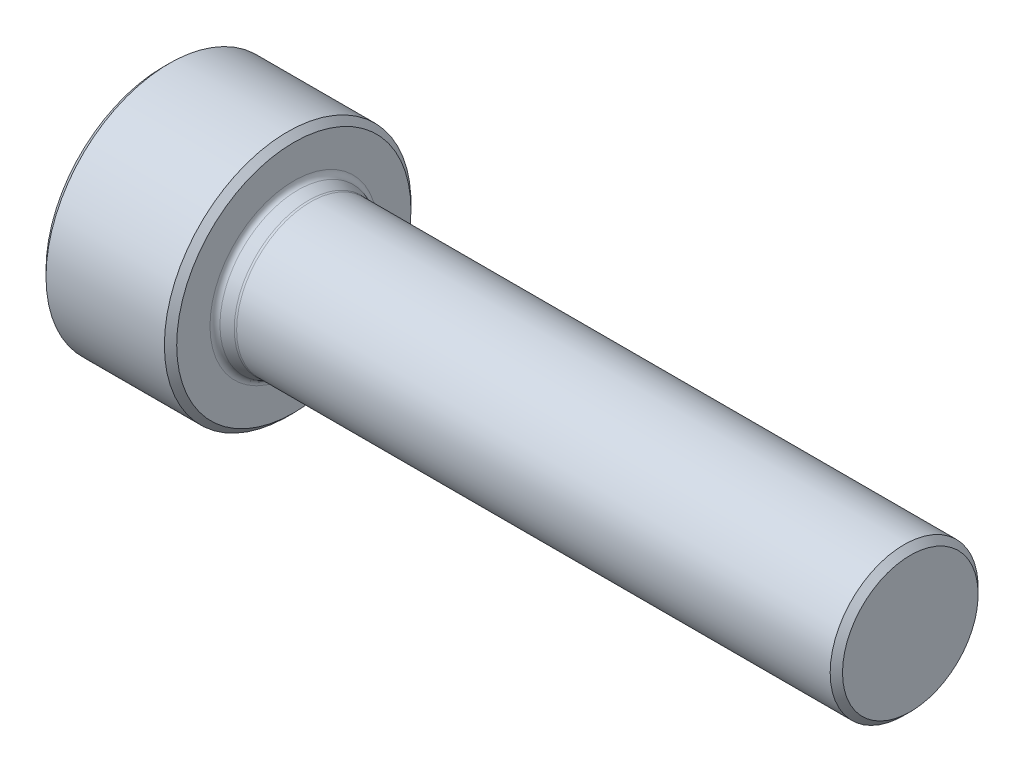
ISO-10303-21;
HEADER;
FILE_DESCRIPTION(('STEP AP214'),'2;1');
FILE_NAME('part.step','',(''),(''),'','','');
FILE_SCHEMA(('AUTOMOTIVE_DESIGN { 1 0 10303 214 1 1 1 1 }'));
ENDSEC;
DATA;
#1=APPLICATION_CONTEXT('core data for automotive mechanical design processes');
#2=APPLICATION_PROTOCOL_DEFINITION('international standard','automotive_design',2000,#1);
#3=PRODUCT_CONTEXT('',#1,'mechanical');
#4=PRODUCT('Part','Part','',(#3));
#5=PRODUCT_RELATED_PRODUCT_CATEGORY('part','',(#4));
#6=PRODUCT_DEFINITION_FORMATION('','',#4);
#7=PRODUCT_DEFINITION_CONTEXT('part definition',#1,'design');
#8=PRODUCT_DEFINITION('design','',#6,#7);
#9=PRODUCT_DEFINITION_SHAPE('','',#8);
#10=(LENGTH_UNIT() NAMED_UNIT(*) SI_UNIT(.MILLI.,.METRE.));
#11=(NAMED_UNIT(*) PLANE_ANGLE_UNIT() SI_UNIT($,.RADIAN.));
#12=(NAMED_UNIT(*) SI_UNIT($,.STERADIAN.) SOLID_ANGLE_UNIT());
#13=UNCERTAINTY_MEASURE_WITH_UNIT(LENGTH_MEASURE(1.E-05),#10,'distance_accuracy_value','');
#14=(GEOMETRIC_REPRESENTATION_CONTEXT(3) GLOBAL_UNCERTAINTY_ASSIGNED_CONTEXT((#13)) GLOBAL_UNIT_ASSIGNED_CONTEXT((#10,
#11,#12)) REPRESENTATION_CONTEXT('',''));
#15=CARTESIAN_POINT('',(0.,0.,0.));
#16=DIRECTION('',(0.,0.,1.));
#17=DIRECTION('',(1.,0.,0.));
#18=AXIS2_PLACEMENT_3D('',#15,#16,#17);
#19=CARTESIAN_POINT('',(0.679999999999998,0.,0.));
#20=DIRECTION('',(-1.,0.,0.));
#21=DIRECTION('',(0.,0.,0.999999999999998));
#22=AXIS2_PLACEMENT_3D('',#19,#20,#21);
#23=TOROIDAL_SURFACE('',#22,3.25,0.25);
#24=CARTESIAN_POINT('',(0.597656960920519,0.,0.));
#25=DIRECTION('',(-1.,0.,0.));
#26=DIRECTION('',(0.,0.,0.999999999999998));
#27=AXIS2_PLACEMENT_3D('',#24,#25,#26);
#28=CIRCLE('',#27,3.01394995463856);
#29=CARTESIAN_POINT('',(0.597656960920523,0.,3.01394995463845));
#30=VERTEX_POINT('',#29);
#31=EDGE_CURVE('E339',#30,#30,#28,.T.);
#32=ORIENTED_EDGE('',*,*,#31,.F.);
#33=EDGE_LOOP('',(#32));
#34=FACE_BOUND('',#33,.T.);
#35=CARTESIAN_POINT('',(0.680000000000019,0.,0.));
#36=DIRECTION('',(-1.,0.,0.));
#37=DIRECTION('',(0.,0.,0.999999999999998));
#38=AXIS2_PLACEMENT_3D('',#35,#36,#37);
#39=CIRCLE('',#38,3.);
#40=CARTESIAN_POINT('',(0.680000000000023,0.,2.99999999999992));
#41=VERTEX_POINT('',#40);
#42=EDGE_CURVE('E356',#41,#41,#39,.T.);
#43=ORIENTED_EDGE('',*,*,#42,.T.);
#44=EDGE_LOOP('',(#43));
#45=FACE_BOUND('',#44,.T.);
#46=ADVANCED_FACE('F38',(#34,#45),#23,.F.);
#47=CARTESIAN_POINT('',(0.597656960920519,0.,0.));
#48=DIRECTION('',(-1.,0.,0.));
#49=DIRECTION('',(0.,0.,0.999999999999998));
#50=AXIS2_PLACEMENT_3D('',#47,#48,#49);
#51=CONICAL_SURFACE('',#50,3.01394995463856,0.335638550327499);
#52=CARTESIAN_POINT('',(0.167656960920358,0.,0.));
#53=DIRECTION('',(-1.,0.,0.));
#54=DIRECTION('',(0.,0.,0.999999999999998));
#55=AXIS2_PLACEMENT_3D('',#52,#53,#54);
#56=CIRCLE('',#55,3.16394995463856);
#57=CARTESIAN_POINT('',(0.167656960920362,0.,3.16394995463848));
#58=VERTEX_POINT('',#57);
#59=EDGE_CURVE('E342',#58,#58,#56,.T.);
#60=ORIENTED_EDGE('',*,*,#59,.F.);
#61=EDGE_LOOP('',(#60));
#62=FACE_BOUND('',#61,.T.);
#63=ORIENTED_EDGE('',*,*,#31,.T.);
#64=EDGE_LOOP('',(#63));
#65=FACE_BOUND('',#64,.T.);
#66=ADVANCED_FACE('F288',(#62,#65),#51,.T.);
#67=CARTESIAN_POINT('',(0.250000000000007,0.,0.));
#68=DIRECTION('',(-1.,0.,0.));
#69=DIRECTION('',(0.,0.,0.999999999999998));
#70=AXIS2_PLACEMENT_3D('',#67,#68,#69);
#71=TOROIDAL_SURFACE('',#70,3.4,0.25);
#72=CARTESIAN_POINT('',(0.,0.,0.));
#73=DIRECTION('',(-1.,0.,0.));
#74=DIRECTION('',(0.,0.,0.999999999999998));
#75=AXIS2_PLACEMENT_3D('',#72,#73,#74);
#76=CIRCLE('',#75,3.4);
#77=CARTESIAN_POINT('',(0.,0.,3.39999999999999));
#78=VERTEX_POINT('',#77);
#79=EDGE_CURVE('E345',#78,#78,#76,.T.);
#80=ORIENTED_EDGE('',*,*,#79,.F.);
#81=EDGE_LOOP('',(#80));
#82=FACE_BOUND('',#81,.T.);
#83=ORIENTED_EDGE('',*,*,#59,.T.);
#84=EDGE_LOOP('',(#83));
#85=FACE_BOUND('',#84,.T.);
#86=ADVANCED_FACE('F294',(#82,#85),#71,.F.);
#87=CARTESIAN_POINT('',(0.,5.00000000000001,0.));
#88=DIRECTION('',(-1.,0.,0.));
#89=DIRECTION('',(0.,0.,0.999999999999998));
#90=AXIS2_PLACEMENT_3D('',#87,#88,#89);
#91=PLANE('',#90);
#92=CARTESIAN_POINT('',(0.,0.,0.));
#93=DIRECTION('',(-1.,0.,0.));
#94=DIRECTION('',(0.,0.,0.999999999999998));
#95=AXIS2_PLACEMENT_3D('',#92,#93,#94);
#96=CIRCLE('',#95,4.74999999999998);
#97=CARTESIAN_POINT('',(0.,0.,4.74999999999998));
#98=VERTEX_POINT('',#97);
#99=EDGE_CURVE('E46',#98,#98,#96,.F.);
#100=ORIENTED_EDGE('',*,*,#99,.T.);
#101=EDGE_LOOP('',(#100));
#102=FACE_BOUND('',#101,.T.);
#103=ORIENTED_EDGE('',*,*,#79,.T.);
#104=EDGE_LOOP('',(#103));
#105=FACE_BOUND('',#104,.T.);
#106=ADVANCED_FACE('F544',(#102,#105),#91,.F.);
#107=CARTESIAN_POINT('',(-1000.,2.56739074444567E-13,-9.54097911787244E-13));
#108=DIRECTION('',(-1.,0.,0.));
#109=DIRECTION('',(0.,0.,0.999999999999998));
#110=AXIS2_PLACEMENT_3D('',#107,#108,#109);
#111=CYLINDRICAL_SURFACE('',#110,5.);
#112=CARTESIAN_POINT('',(-0.249999999999979,0.,0.));
#113=DIRECTION('',(-1.,0.,0.));
#114=DIRECTION('',(0.,0.,0.999999999999998));
#115=AXIS2_PLACEMENT_3D('',#112,#113,#114);
#116=CIRCLE('',#115,5.);
#117=CARTESIAN_POINT('',(-0.249999999999973,0.,4.99999999999998));
#118=VERTEX_POINT('',#117);
#119=EDGE_CURVE('E311',#118,#118,#116,.T.);
#120=ORIENTED_EDGE('',*,*,#119,.T.);
#121=EDGE_LOOP('',(#120));
#122=FACE_BOUND('',#121,.T.);
#123=CARTESIAN_POINT('',(-5.05000000000001,0.,0.));
#124=DIRECTION('',(1.,0.,0.));
#125=DIRECTION('',(0.,0.,-0.999999999999998));
#126=AXIS2_PLACEMENT_3D('',#123,#124,#125);
#127=CIRCLE('',#126,5.);
#128=CARTESIAN_POINT('',(-5.05000000000001,0.,-5.));
#129=VERTEX_POINT('',#128);
#130=EDGE_CURVE('E313',#129,#129,#127,.T.);
#131=ORIENTED_EDGE('',*,*,#130,.T.);
#132=EDGE_LOOP('',(#131));
#133=FACE_BOUND('',#132,.T.);
#134=ADVANCED_FACE('F537',(#122,#133),#111,.T.);
#135=CARTESIAN_POINT('',(-5.29999999999998,3.05000000000006,0.));
#136=DIRECTION('',(1.,0.,0.));
#137=DIRECTION('',(0.,0.,-0.999999999999998));
#138=AXIS2_PLACEMENT_3D('',#135,#136,#137);
#139=PLANE('',#138);
#140=CARTESIAN_POINT('',(-5.29999999999999,0.,0.));
#141=DIRECTION('',(1.,0.,0.));
#142=DIRECTION('',(0.,0.,-0.999999999999998));
#143=AXIS2_PLACEMENT_3D('',#140,#141,#142);
#144=CIRCLE('',#143,4.74999999999996);
#145=CARTESIAN_POINT('',(-5.29999999999999,0.,-4.74999999999995));
#146=VERTEX_POINT('',#145);
#147=EDGE_CURVE('E11',#146,#146,#144,.F.);
#148=ORIENTED_EDGE('',*,*,#147,.T.);
#149=EDGE_LOOP('',(#148));
#150=FACE_BOUND('',#149,.T.);
#151=CARTESIAN_POINT('',(-5.29999999999999,0.,0.));
#152=DIRECTION('',(-1.,0.,0.));
#153=DIRECTION('',(0.,0.,0.999999999999998));
#154=AXIS2_PLACEMENT_3D('',#151,#152,#153);
#155=CIRCLE('',#154,3.05);
#156=CARTESIAN_POINT('',(-5.29999999999998,0.,3.05));
#157=VERTEX_POINT('',#156);
#158=EDGE_CURVE('E348',#157,#157,#155,.T.);
#159=ORIENTED_EDGE('',*,*,#158,.F.);
#160=EDGE_LOOP('',(#159));
#161=FACE_BOUND('',#160,.T.);
#162=ADVANCED_FACE('F531',(#150,#161),#139,.F.);
#163=CARTESIAN_POINT('',(-5.29999999999999,0.,0.));
#164=DIRECTION('',(-1.,0.,0.));
#165=DIRECTION('',(0.,0.,0.999999999999998));
#166=AXIS2_PLACEMENT_3D('',#163,#164,#165);
#167=CONICAL_SURFACE('',#166,3.05,1.04719755119662);
#168=CARTESIAN_POINT('',(-5.19325532894204,-1.46526507548724,2.46208644269986));
#169=CARTESIAN_POINT('',(-5.15766472171041,-1.5283279620043,2.35285831918034));
#170=CARTESIAN_POINT('',(-5.12545596581209,-1.59193559577916,2.24268666573303));
#171=CARTESIAN_POINT('',(-5.06959964059111,-1.72022142832329,2.02048908587531));
#172=CARTESIAN_POINT('',(-5.04597119030723,-1.78490168613824,1.90845959309317));
#173=CARTESIAN_POINT('',(-5.0096879698187,-1.91347103746246,1.68577094430345));
#174=CARTESIAN_POINT('',(-4.9967833715607,-1.97734184669061,1.57514345759976));
#175=CARTESIAN_POINT('',(-4.9822370860314,-2.10534031267397,1.3534436112257));
#176=CARTESIAN_POINT('',(-4.98058242824987,-2.16946758831854,1.24237191165834));
#177=CARTESIAN_POINT('',(-4.98795303032496,-2.28638871297862,1.03985858326898));
#178=CARTESIAN_POINT('',(-4.99517060429367,-2.33921362953304,0.94836314389113));
#179=CARTESIAN_POINT('',(-5.01687831753634,-2.44452487328064,0.765958719112015));
#180=CARTESIAN_POINT('',(-5.03137403778879,-2.49701090928525,0.675050238064138));
#181=CARTESIAN_POINT('',(-5.06715062847953,-2.60249118998248,0.492353032699907));
#182=CARTESIAN_POINT('',(-5.08856400688446,-2.65547392697089,0.400584240311922));
#183=CARTESIAN_POINT('',(-5.13698256530631,-2.76070825819038,0.21831303193924));
#184=CARTESIAN_POINT('',(-5.16397835941685,-2.81296092447986,0.127808759094928));
#185=CARTESIAN_POINT('',(-5.19325532894205,-2.86486194343505,0.0379135572999966));
#186=B_SPLINE_CURVE_WITH_KNOTS('',3,(#168,#169,#170,#171,#172,#173,#174,#175,#176,#177,#178,
#179,#180,#181,#182,#183,#184,#185),.UNSPECIFIED.,.F.,.F.,(4,2,2,2,2,2,2,2,4),(0.,
0.393304750472036,0.787480580008915,1.17219339661903,1.55646258697413,1.87388884203899,
2.19155887633405,2.51571571083202,2.83933189726567),.UNSPECIFIED.);
#187=CARTESIAN_POINT('',(-5.19319020019989,-1.46538054554108,2.46188644269987));
#188=VERTEX_POINT('',#187);
#189=CARTESIAN_POINT('',(-5.1931902001999,-2.86474647338119,0.0381135573000145));
#190=VERTEX_POINT('',#189);
#191=EDGE_CURVE('E53',#188,#190,#186,.T.);
#192=ORIENTED_EDGE('',*,*,#191,.T.);
#193=CARTESIAN_POINT('',(-5.19319020019992,0.,0.));
#194=DIRECTION('',(-1.,0.,0.));
#195=DIRECTION('',(0.,0.,0.999999999999998));
#196=AXIS2_PLACEMENT_3D('',#193,#194,#195);
#197=CIRCLE('',#196,2.865);
#198=CARTESIAN_POINT('',(-5.1931902001999,-2.86474647338118,-0.0381135573000319));
#199=VERTEX_POINT('',#198);
#200=EDGE_CURVE('E156',#190,#199,#197,.F.);
#201=ORIENTED_EDGE('',*,*,#200,.T.);
#202=CARTESIAN_POINT('',(-5.19325532894205,-2.86486194343502,-0.0379135573000157));
#203=CARTESIAN_POINT('',(-5.15766472171046,-2.80179905691798,-0.147141680819556));
#204=CARTESIAN_POINT('',(-5.12545596581215,-2.73819142314312,-0.257313334266877));
#205=CARTESIAN_POINT('',(-5.06959964059117,-2.60990559059899,-0.479510914124604));
#206=CARTESIAN_POINT('',(-5.04597119030728,-2.54522533278404,-0.591540406906741));
#207=CARTESIAN_POINT('',(-5.00968796981875,-2.41665598145981,-0.814229055696471));
#208=CARTESIAN_POINT('',(-4.99678337156075,-2.35278517223166,-0.924856542400164));
#209=CARTESIAN_POINT('',(-4.98223708603144,-2.2247867062483,-1.14655638877423));
#210=CARTESIAN_POINT('',(-4.98058242824988,-2.16065943060374,-1.2576280883416));
#211=CARTESIAN_POINT('',(-4.98795303032497,-2.04373830594365,-1.46014141673096));
#212=CARTESIAN_POINT('',(-4.9951706042937,-1.99091338938923,-1.55163685610881));
#213=CARTESIAN_POINT('',(-5.01687831753638,-1.88560214564162,-1.73404128088792));
#214=CARTESIAN_POINT('',(-5.03137403778882,-1.83311610963701,-1.8249497619358));
#215=CARTESIAN_POINT('',(-5.06715062847955,-1.72763582893978,-2.00764696730004));
#216=CARTESIAN_POINT('',(-5.08856400688449,-1.67465309195137,-2.09941575968803));
#217=CARTESIAN_POINT('',(-5.13698256530633,-1.56941876073187,-2.28168696806072));
#218=CARTESIAN_POINT('',(-5.16397835941687,-1.51716609444238,-2.37219124090503));
#219=CARTESIAN_POINT('',(-5.19325532894204,-1.46526507548718,-2.46208644269997));
#220=B_SPLINE_CURVE_WITH_KNOTS('',3,(#202,#203,#204,#205,#206,#207,#208,#209,#210,#211,#212,
#213,#214,#215,#216,#217,#218,#219),.UNSPECIFIED.,.F.,.F.,(4,2,2,2,2,2,2,2,4),(0.,
0.39330475047204,0.787480580008931,1.17219339661906,1.55646258697417,1.87388884203903,
2.1915588763341,2.51571571083209,2.83933189726574),.UNSPECIFIED.);
#221=CARTESIAN_POINT('',(-5.1931902001999,-1.46538054554102,-2.4618864427));
#222=VERTEX_POINT('',#221);
#223=EDGE_CURVE('E359',#199,#222,#220,.T.);
#224=ORIENTED_EDGE('',*,*,#223,.T.);
#225=CARTESIAN_POINT('',(-5.19319020019992,0.,0.));
#226=DIRECTION('',(-1.,0.,0.));
#227=DIRECTION('',(0.,0.,0.999999999999998));
#228=AXIS2_PLACEMENT_3D('',#225,#226,#227);
#229=CIRCLE('',#228,2.865);
#230=CARTESIAN_POINT('',(-5.19319020019991,-1.39936592784017,-2.50000000000004));
#231=VERTEX_POINT('',#230);
#232=EDGE_CURVE('E325',#222,#231,#229,.F.);
#233=ORIENTED_EDGE('',*,*,#232,.T.);
#234=CARTESIAN_POINT('',(-6.16572533220391,-3.80102231553525,-2.49999999999999));
#235=CARTESIAN_POINT('',(-6.11336526561239,-3.69244315774157,-2.50000000000004));
#236=CARTESIAN_POINT('',(-6.06152978511482,-3.58360640396363,-2.50000000000006));
#237=CARTESIAN_POINT('',(-5.95920469201479,-3.36528040108559,-2.50000000000008));
#238=CARTESIAN_POINT('',(-5.90871530794208,-3.255791045004,-2.50000000000007));
#239=CARTESIAN_POINT('',(-5.80910854925367,-3.03542097334839,-2.50000000000007));
#240=CARTESIAN_POINT('',(-5.76000084668113,-2.92453587013209,-2.50000000000007));
#241=CARTESIAN_POINT('',(-5.66389958886518,-2.70185660134206,-2.50000000000007));
#242=CARTESIAN_POINT('',(-5.61690592817436,-2.59006248143883,-2.50000000000007));
#243=CARTESIAN_POINT('',(-5.52425320150067,-2.36208953671569,-2.50000000000007));
#244=CARTESIAN_POINT('',(-5.478673608012,-2.24587822757554,-2.50000000000007));
#245=CARTESIAN_POINT('',(-5.39115199519386,-2.01206819615253,-2.50000000000007));
#246=CARTESIAN_POINT('',(-5.34921039442915,-1.89446931598799,-2.50000000000007));
#247=CARTESIAN_POINT('',(-5.27012193811413,-1.65794298666687,-2.50000000000008));
#248=CARTESIAN_POINT('',(-5.23296467647525,-1.5390190538478,-2.50000000000009));
#249=CARTESIAN_POINT('',(-5.16468698469541,-1.29946783039598,-2.50000000000005));
#250=CARTESIAN_POINT('',(-5.13356457039831,-1.17884111365099,-2.5));
#251=CARTESIAN_POINT('',(-5.07905956854692,-0.936468241403412,-2.5));
#252=CARTESIAN_POINT('',(-5.05563813437706,-0.814730990552048,-2.50000000000005));
#253=CARTESIAN_POINT('',(-5.01791044481886,-0.569825935402885,-2.50000000000009));
#254=CARTESIAN_POINT('',(-5.00360348611482,-0.446658242231726,-2.50000000000008));
#255=CARTESIAN_POINT('',(-4.98543401980991,-0.201082162402357,-2.50000000000007));
#256=CARTESIAN_POINT('',(-4.98144333929562,-0.0786834955223037,-2.50000000000007));
#257=CARTESIAN_POINT('',(-4.98391167452575,0.166016037954554,-2.50000000000007));
#258=CARTESIAN_POINT('',(-4.99037106144511,0.2883169009231,-2.50000000000008));
#259=CARTESIAN_POINT('',(-5.0099866980372,0.498282346570998,-2.50000000000007));
#260=CARTESIAN_POINT('',(-5.02079868406145,0.586177711052386,-2.50000000000007));
#261=CARTESIAN_POINT('',(-5.04710378246711,0.761271661361362,-2.50000000000007));
#262=CARTESIAN_POINT('',(-5.06259759854389,0.848470140420921,-2.50000000000007));
#263=CARTESIAN_POINT('',(-5.11528372563794,1.10892406522679,-2.50000000000007));
#264=CARTESIAN_POINT('',(-5.15866927255903,1.28092926658715,-2.50000000000007));
#265=CARTESIAN_POINT('',(-5.25837625738126,1.62499847950062,-2.50000000000007));
#266=CARTESIAN_POINT('',(-5.31495461202518,1.79698500608815,-2.50000000000006));
#267=CARTESIAN_POINT('',(-5.43665061465804,2.137799044028,-2.50000000000008));
#268=CARTESIAN_POINT('',(-5.5017655031832,2.30662755615321,-2.5000000000001));
#269=CARTESIAN_POINT('',(-5.65359772423823,2.68050113146887,-2.50000000000011));
#270=CARTESIAN_POINT('',(-5.74183441442138,2.88492205613048,-2.50000000000008));
#271=CARTESIAN_POINT('',(-5.92413974168125,3.29116276699637,-2.50000000000006));
#272=CARTESIAN_POINT('',(-6.01820952390141,3.49298203299367,-2.50000000000007));
#273=CARTESIAN_POINT('',(-6.21037707426031,3.89488495482409,-2.50000000000007));
#274=CARTESIAN_POINT('',(-6.30847804510226,4.09496707146593,-2.50000000000007));
#275=CARTESIAN_POINT('',(-6.5074555212869,4.49374766911943,-2.50000000000007));
#276=CARTESIAN_POINT('',(-6.60833210402266,4.69244611135578,-2.50000000000007));
#277=CARTESIAN_POINT('',(-6.80450110587626,5.07403608841921,-2.50000000000007));
#278=CARTESIAN_POINT('',(-6.89964933021011,5.25700193741456,-2.50000000000007));
#279=CARTESIAN_POINT('',(-7.091258797721,5.62224991025143,-2.50000000000006));
#280=CARTESIAN_POINT('',(-7.18772007464676,5.80453201636487,-2.50000000000006));
#281=CARTESIAN_POINT('',(-7.38146059316392,6.16818784892074,-2.50000000000007));
#282=CARTESIAN_POINT('',(-7.4787377896344,6.34956266639672,-2.50000000000007));
#283=CARTESIAN_POINT('',(-7.67409723166738,6.71186786100943,-2.50000000000006));
#284=CARTESIAN_POINT('',(-7.77217944075062,6.89279825780766,-2.50000000000006));
#285=CARTESIAN_POINT('',(-7.87056623406482,7.07356171621027,-2.50000000000005));
#286=B_SPLINE_CURVE_WITH_KNOTS('',3,(#234,#235,#236,#237,#238,#239,#240,#241,#242,#243,#244,
#245,#246,#247,#248,#249,#250,#251,#252,#253,#254,#255,#256,#257,#258,#259,#260,#261,#262,#263,
#264,#265,#266,#267,#268,#269,#270,#271,#272,#273,#274,#275,#276,#277,#278,#279,#280,#281,#282,
#283,#284,#285),.UNSPECIFIED.,.F.,.F.,(4,2,2,2,2,2,2,2,2,2,2,2,2,2,2,2,2,2,2,2,2,2,2,2,2,4),(0.,
0.361638727279404,0.723338464769781,1.08713900248318,1.45092137382825,1.82536481800446,
2.19985128632124,2.57350895750923,2.94704356726486,3.31866394034181,3.69025563397214,
4.05720785641597,4.42417311288626,4.68971727630956,4.95530137181447,5.48679605701706,
6.0296626906543,6.57235427150427,7.24016432709904,7.90810590375328,8.57658881535021,
9.24509038534826,9.8637656171695,10.4824567806205,11.0998985815405,11.7173125558005),.UNSPECIFIED.);
#287=CARTESIAN_POINT('',(-5.1931902001999,1.39936592784018,-2.49999999999999));
#288=VERTEX_POINT('',#287);
#289=EDGE_CURVE('E366',#231,#288,#286,.T.);
#290=ORIENTED_EDGE('',*,*,#289,.T.);
#291=CARTESIAN_POINT('',(-5.19319020019992,0.,0.));
#292=DIRECTION('',(-1.,0.,0.));
#293=DIRECTION('',(0.,0.,0.999999999999998));
#294=AXIS2_PLACEMENT_3D('',#291,#292,#293);
#295=CIRCLE('',#294,2.865);
#296=CARTESIAN_POINT('',(-5.1931902001999,1.46538054554103,-2.46188644270006));
#297=VERTEX_POINT('',#296);
#298=EDGE_CURVE('E328',#288,#297,#295,.F.);
#299=ORIENTED_EDGE('',*,*,#298,.T.);
#300=CARTESIAN_POINT('',(-5.19325532894205,1.46526507548721,-2.46208644270005));
#301=CARTESIAN_POINT('',(-5.15766472171046,1.52832796200425,-2.3528583191805));
#302=CARTESIAN_POINT('',(-5.12545596581214,1.59193559577911,-2.24268666573318));
#303=CARTESIAN_POINT('',(-5.06959964059116,1.72022142832324,-2.02048908587545));
#304=CARTESIAN_POINT('',(-5.04597119030727,1.78490168613819,-1.90845959309331));
#305=CARTESIAN_POINT('',(-5.00968796981873,1.91347103746242,-1.68577094430357));
#306=CARTESIAN_POINT('',(-4.99678337156073,1.97734184669057,-1.57514345759988));
#307=CARTESIAN_POINT('',(-4.98223708603142,2.10534031267394,-1.35344361122581));
#308=CARTESIAN_POINT('',(-4.98058242824986,2.1694675883185,-1.24237191165844));
#309=CARTESIAN_POINT('',(-4.98795303032495,2.28638871297858,-1.03985858326907));
#310=CARTESIAN_POINT('',(-4.99517060429368,2.33921362953301,-0.948363143891236));
#311=CARTESIAN_POINT('',(-5.01687831753636,2.44452487328061,-0.765958719112125));
#312=CARTESIAN_POINT('',(-5.0313740377888,2.49701090928522,-0.675050238064247));
#313=CARTESIAN_POINT('',(-5.06715062847953,2.60249118998245,-0.492353032700016));
#314=CARTESIAN_POINT('',(-5.08856400688446,2.65547392697086,-0.400584240312033));
#315=CARTESIAN_POINT('',(-5.1369825653063,2.76070825819034,-0.218313031939344));
#316=CARTESIAN_POINT('',(-5.16397835941685,2.81296092447981,-0.127808759095024));
#317=CARTESIAN_POINT('',(-5.19325532894204,2.86486194343495,-0.0379135573000695));
#318=B_SPLINE_CURVE_WITH_KNOTS('',3,(#300,#301,#302,#303,#304,#305,#306,#307,#308,#309,#310,
#311,#312,#313,#314,#315,#316,#317),.UNSPECIFIED.,.F.,.F.,(4,2,2,2,2,2,2,2,4),(0.,
0.393304750472049,0.787480580008949,1.17219339661908,1.5564625869742,1.87388884203905,
2.19155887633411,2.51571571083208,2.83933189726573),.UNSPECIFIED.);
#319=CARTESIAN_POINT('',(-5.1931902001999,2.86474647338119,-0.0381135573000214));
#320=VERTEX_POINT('',#319);
#321=EDGE_CURVE('E397',#297,#320,#318,.T.);
#322=ORIENTED_EDGE('',*,*,#321,.T.);
#323=CARTESIAN_POINT('',(-5.19319020019992,0.,0.));
#324=DIRECTION('',(-1.,0.,0.));
#325=DIRECTION('',(0.,0.,0.999999999999998));
#326=AXIS2_PLACEMENT_3D('',#323,#324,#325);
#327=CIRCLE('',#326,2.865);
#328=CARTESIAN_POINT('',(-5.1931902001999,2.86474647338117,0.0381135572999451));
#329=VERTEX_POINT('',#328);
#330=EDGE_CURVE('E331',#320,#329,#327,.F.);
#331=ORIENTED_EDGE('',*,*,#330,.T.);
#332=CARTESIAN_POINT('',(-5.19325532894204,2.86486194343505,0.0379135572999376));
#333=CARTESIAN_POINT('',(-5.15766472171043,2.80179905691795,0.147141680819449));
#334=CARTESIAN_POINT('',(-5.12545596581212,2.73819142314307,0.257313334266758));
#335=CARTESIAN_POINT('',(-5.06959964059114,2.60990559059892,0.479510914124477));
#336=CARTESIAN_POINT('',(-5.04597119030724,2.54522533278398,0.591540406906618));
#337=CARTESIAN_POINT('',(-5.0096879698187,2.41665598145976,0.814229055696356));
#338=CARTESIAN_POINT('',(-4.99678337156069,2.35278517223161,0.924856542400054));
#339=CARTESIAN_POINT('',(-4.98223708603139,2.22478670624823,1.14655638877411));
#340=CARTESIAN_POINT('',(-4.98058242824986,2.16065943060364,1.25762808834146));
#341=CARTESIAN_POINT('',(-4.98795303032494,2.04373830594356,1.46014141673083));
#342=CARTESIAN_POINT('',(-4.99517060429365,1.99091338938916,1.55163685610869));
#343=CARTESIAN_POINT('',(-5.01687831753631,1.88560214564157,1.73404128088781));
#344=CARTESIAN_POINT('',(-5.03137403778876,1.83311610963696,1.82494976193568));
#345=CARTESIAN_POINT('',(-5.06715062847949,1.72763582893972,2.00764696729991));
#346=CARTESIAN_POINT('',(-5.08856400688441,1.67465309195131,2.09941575968789));
#347=CARTESIAN_POINT('',(-5.13698256530626,1.56941876073183,2.28168696806059));
#348=CARTESIAN_POINT('',(-5.16397835941682,1.51716609444238,2.37219124090491));
#349=CARTESIAN_POINT('',(-5.19325532894204,1.46526507548725,2.46208644269986));
#350=B_SPLINE_CURVE_WITH_KNOTS('',3,(#332,#333,#334,#335,#336,#337,#338,#339,#340,#341,#342,
#343,#344,#345,#346,#347,#348,#349),.UNSPECIFIED.,.F.,.F.,(4,2,2,2,2,2,2,2,4),(0.,
0.393304750472052,0.787480580008948,1.17219339661908,1.55646258697419,1.87388884203905,
2.19155887633411,2.51571571083208,2.83933189726573),.UNSPECIFIED.);
#351=CARTESIAN_POINT('',(-5.1931902001999,1.46538054554097,2.46188644269986));
#352=VERTEX_POINT('',#351);
#353=EDGE_CURVE('E402',#329,#352,#350,.T.);
#354=ORIENTED_EDGE('',*,*,#353,.T.);
#355=CARTESIAN_POINT('',(-5.19319020019992,0.,0.));
#356=DIRECTION('',(-1.,0.,0.));
#357=DIRECTION('',(0.,0.,0.999999999999998));
#358=AXIS2_PLACEMENT_3D('',#355,#356,#357);
#359=CIRCLE('',#358,2.865);
#360=CARTESIAN_POINT('',(-5.1931902001999,1.39936592784009,2.4999999999999));
#361=VERTEX_POINT('',#360);
#362=EDGE_CURVE('E334',#352,#361,#359,.F.);
#363=ORIENTED_EDGE('',*,*,#362,.T.);
#364=CARTESIAN_POINT('',(-6.16572533220391,-3.8010223155353,2.49999999999993));
#365=CARTESIAN_POINT('',(-6.11336526561237,-3.69244315774161,2.49999999999992));
#366=CARTESIAN_POINT('',(-6.0615297851148,-3.58360640396367,2.49999999999992));
#367=CARTESIAN_POINT('',(-5.95920469201476,-3.36528040108563,2.49999999999992));
#368=CARTESIAN_POINT('',(-5.90871530794205,-3.25579104500404,2.49999999999992));
#369=CARTESIAN_POINT('',(-5.80910854925363,-3.03542097334842,2.49999999999992));
#370=CARTESIAN_POINT('',(-5.76000084668109,-2.92453587013211,2.49999999999992));
#371=CARTESIAN_POINT('',(-5.66389958886514,-2.70185660134209,2.49999999999992));
#372=CARTESIAN_POINT('',(-5.61690592817431,-2.59006248143885,2.49999999999992));
#373=CARTESIAN_POINT('',(-5.52425320150062,-2.36208953671571,2.49999999999992));
#374=CARTESIAN_POINT('',(-5.47867360801194,-2.24587822757556,2.49999999999992));
#375=CARTESIAN_POINT('',(-5.3911519951938,-2.01206819615254,2.49999999999992));
#376=CARTESIAN_POINT('',(-5.34921039442909,-1.894469315988,2.49999999999992));
#377=CARTESIAN_POINT('',(-5.27012193811406,-1.65794298666688,2.49999999999992));
#378=CARTESIAN_POINT('',(-5.23296467647515,-1.53901905384781,2.49999999999991));
#379=CARTESIAN_POINT('',(-5.16468698469536,-1.29946783039596,2.49999999999993));
#380=CARTESIAN_POINT('',(-5.13356457039832,-1.17884111365095,2.49999999999996));
#381=CARTESIAN_POINT('',(-5.07905956854693,-0.93646824140337,2.49999999999996));
#382=CARTESIAN_POINT('',(-5.055638134377,-0.814730990552028,2.49999999999993));
#383=CARTESIAN_POINT('',(-5.01791044481876,-0.569825935402895,2.49999999999991));
#384=CARTESIAN_POINT('',(-5.00360348611474,-0.446658242231743,2.49999999999992));
#385=CARTESIAN_POINT('',(-4.98543401980983,-0.201082162402394,2.49999999999992));
#386=CARTESIAN_POINT('',(-4.98144333929551,-0.078683495522352,2.49999999999991));
#387=CARTESIAN_POINT('',(-4.98391167452569,0.166016037954482,2.49999999999993));
#388=CARTESIAN_POINT('',(-4.99037106144511,0.288316900923015,2.49999999999996));
#389=CARTESIAN_POINT('',(-5.00998669803718,0.498282346570915,2.49999999999995));
#390=CARTESIAN_POINT('',(-5.02079868406138,0.586177711052315,2.49999999999993));
#391=CARTESIAN_POINT('',(-5.04710378246701,0.761271661361305,2.49999999999992));
#392=CARTESIAN_POINT('',(-5.06259759854379,0.848470140420867,2.49999999999992));
#393=CARTESIAN_POINT('',(-5.11528372563787,1.10892406522675,2.49999999999993));
#394=CARTESIAN_POINT('',(-5.15866927255896,1.28092926658711,2.49999999999993));
#395=CARTESIAN_POINT('',(-5.25837625738118,1.62499847950059,2.49999999999992));
#396=CARTESIAN_POINT('',(-5.3149546120251,1.79698500608813,2.49999999999992));
#397=CARTESIAN_POINT('',(-5.43665061465798,2.13779904402798,2.49999999999993));
#398=CARTESIAN_POINT('',(-5.50176550318317,2.30662755615319,2.49999999999993));
#399=CARTESIAN_POINT('',(-5.65359772423821,2.68050113146886,2.49999999999993));
#400=CARTESIAN_POINT('',(-5.74183441442135,2.88492205613049,2.49999999999993));
#401=CARTESIAN_POINT('',(-5.92413974168121,3.29116276699639,2.49999999999992));
#402=CARTESIAN_POINT('',(-6.01820952390138,3.49298203299369,2.49999999999993));
#403=CARTESIAN_POINT('',(-6.21037707426028,3.8948849548241,2.49999999999993));
#404=CARTESIAN_POINT('',(-6.30847804510224,4.09496707146595,2.49999999999993));
#405=CARTESIAN_POINT('',(-6.50745552128688,4.49374766911944,2.49999999999993));
#406=CARTESIAN_POINT('',(-6.60833210402263,4.69244611135579,2.49999999999993));
#407=CARTESIAN_POINT('',(-6.80450110587624,5.07403608841922,2.49999999999993));
#408=CARTESIAN_POINT('',(-6.89964933021008,5.25700193741457,2.49999999999993));
#409=CARTESIAN_POINT('',(-7.09125879772098,5.62224991025144,2.49999999999993));
#410=CARTESIAN_POINT('',(-7.18772007464674,5.80453201636488,2.49999999999993));
#411=CARTESIAN_POINT('',(-7.3814605931639,6.16818784892075,2.49999999999993));
#412=CARTESIAN_POINT('',(-7.47873778963438,6.34956266639673,2.49999999999993));
#413=CARTESIAN_POINT('',(-7.67409723166737,6.71186786100944,2.49999999999993));
#414=CARTESIAN_POINT('',(-7.77217944075062,6.89279825780767,2.49999999999992));
#415=CARTESIAN_POINT('',(-7.87056623406484,7.07356171621026,2.4999999999999));
#416=B_SPLINE_CURVE_WITH_KNOTS('',3,(#364,#365,#366,#367,#368,#369,#370,#371,#372,#373,#374,
#375,#376,#377,#378,#379,#380,#381,#382,#383,#384,#385,#386,#387,#388,#389,#390,#391,#392,#393,
#394,#395,#396,#397,#398,#399,#400,#401,#402,#403,#404,#405,#406,#407,#408,#409,#410,#411,#412,
#413,#414,#415),.UNSPECIFIED.,.F.,.F.,(4,2,2,2,2,2,2,2,2,2,2,2,2,2,2,2,2,2,2,2,2,2,2,2,2,4),(0.,
0.361638727279423,0.723338464769815,1.08713900248322,1.45092137382829,1.82536481800451,
2.1998512863213,2.5735089575093,2.94704356726496,3.31866394034188,3.69025563397218,
4.05720785641597,4.42417311288624,4.68971727630956,4.95530137181448,5.4867960570171,
6.02966269065435,6.57235427150435,7.24016432709913,7.90810590375338,8.5765888153503,
9.24509038534836,9.8637656171696,10.4824567806206,11.0998985815406,11.7173125558006),.UNSPECIFIED.);
#417=CARTESIAN_POINT('',(-5.1931902001999,-1.39936592784027,2.49999999999996));
#418=VERTEX_POINT('',#417);
#419=EDGE_CURVE('E244',#361,#418,#416,.F.);
#420=ORIENTED_EDGE('',*,*,#419,.T.);
#421=CARTESIAN_POINT('',(-5.19319020019992,0.,0.));
#422=DIRECTION('',(-1.,0.,0.));
#423=DIRECTION('',(0.,0.,0.999999999999998));
#424=AXIS2_PLACEMENT_3D('',#421,#422,#423);
#425=CIRCLE('',#424,2.865);
#426=EDGE_CURVE('E337',#418,#188,#425,.F.);
#427=ORIENTED_EDGE('',*,*,#426,.T.);
#428=EDGE_LOOP('',(#192,#201,#224,#233,#290,#299,#322,#331,#354,#363,#420,#427));
#429=FACE_BOUND('',#428,.T.);
#430=ORIENTED_EDGE('',*,*,#158,.T.);
#431=EDGE_LOOP('',(#430));
#432=FACE_BOUND('',#431,.T.);
#433=ADVANCED_FACE('F251',(#429,#432),#167,.F.);
#434=CARTESIAN_POINT('',(25.0000000000001,2.9999999999999,0.));
#435=DIRECTION('',(-1.,0.,0.));
#436=DIRECTION('',(0.,0.,0.999999999999998));
#437=AXIS2_PLACEMENT_3D('',#434,#435,#436);
#438=PLANE('',#437);
#439=CARTESIAN_POINT('',(25.0000000000001,0.,0.));
#440=DIRECTION('',(-1.,0.,0.));
#441=DIRECTION('',(0.,0.,0.999999999999998));
#442=AXIS2_PLACEMENT_3D('',#439,#440,#441);
#443=CIRCLE('',#442,2.74999999999989);
#444=CARTESIAN_POINT('',(25.0000000000001,0.,2.74999999999991));
#445=VERTEX_POINT('',#444);
#446=EDGE_CURVE('E316',#445,#445,#443,.F.);
#447=ORIENTED_EDGE('',*,*,#446,.T.);
#448=EDGE_LOOP('',(#447));
#449=FACE_BOUND('',#448,.T.);
#450=ADVANCED_FACE('F268',(#449),#438,.F.);
#451=CARTESIAN_POINT('',(-1000.,2.56739074444567E-13,-9.54097911787244E-13));
#452=DIRECTION('',(-1.,0.,0.));
#453=DIRECTION('',(0.,0.,0.999999999999998));
#454=AXIS2_PLACEMENT_3D('',#451,#452,#453);
#455=CYLINDRICAL_SURFACE('',#454,3.);
#456=CARTESIAN_POINT('',(24.7500000000001,0.,0.));
#457=DIRECTION('',(-1.,0.,0.));
#458=DIRECTION('',(0.,0.,0.999999999999998));
#459=AXIS2_PLACEMENT_3D('',#456,#457,#458);
#460=CIRCLE('',#459,3.);
#461=CARTESIAN_POINT('',(24.7500000000001,0.,2.99999999999998));
#462=VERTEX_POINT('',#461);
#463=EDGE_CURVE('E321',#462,#462,#460,.T.);
#464=ORIENTED_EDGE('',*,*,#463,.T.);
#465=EDGE_LOOP('',(#464));
#466=FACE_BOUND('',#465,.T.);
#467=ORIENTED_EDGE('',*,*,#42,.F.);
#468=EDGE_LOOP('',(#467));
#469=FACE_BOUND('',#468,.T.);
#470=ADVANCED_FACE('F265',(#466,#469),#455,.T.);
#471=CARTESIAN_POINT('',(-2.29999999999999,0.,0.));
#472=DIRECTION('',(-1.,0.,0.));
#473=DIRECTION('',(0.,0.,0.999999999999998));
#474=AXIS2_PLACEMENT_3D('',#471,#472,#473);
#475=CYLINDRICAL_SURFACE('',#474,2.865);
#476=DIRECTION('',(-1.,0.,0.));
#477=VECTOR('',#476,1.);
#478=CARTESIAN_POINT('',(-2.29999999999997,-2.8647464733812,0.0381135572999451));
#479=LINE('',#478,#477);
#480=CARTESIAN_POINT('',(-2.29999999999997,-2.8647464733812,0.0381135572999451));
#481=VERTEX_POINT('',#480);
#482=EDGE_CURVE('E150',#481,#190,#479,.T.);
#483=ORIENTED_EDGE('',*,*,#482,.F.);
#484=CARTESIAN_POINT('',(-2.29999999999999,0.,0.));
#485=DIRECTION('',(-1.,0.,0.));
#486=DIRECTION('',(0.,0.,0.999999999999998));
#487=AXIS2_PLACEMENT_3D('',#484,#485,#486);
#488=CIRCLE('',#487,2.865);
#489=CARTESIAN_POINT('',(-2.29999999999998,-2.86474647338125,-0.0381135573001169));
#490=VERTEX_POINT('',#489);
#491=EDGE_CURVE('E155',#490,#481,#488,.T.);
#492=ORIENTED_EDGE('',*,*,#491,.F.);
#493=DIRECTION('',(-1.,0.,0.));
#494=VECTOR('',#493,1.);
#495=CARTESIAN_POINT('',(-2.29999999999998,-2.86474647338125,-0.0381135573001169));
#496=LINE('',#495,#494);
#497=EDGE_CURVE('E206',#490,#199,#496,.T.);
#498=ORIENTED_EDGE('',*,*,#497,.T.);
#499=ORIENTED_EDGE('',*,*,#200,.F.);
#500=EDGE_LOOP('',(#483,#492,#498,#499));
#501=FACE_BOUND('',#500,.T.);
#502=ADVANCED_FACE('F152',(#501),#475,.F.);
#503=CARTESIAN_POINT('',(-2.29999999999999,0.,0.));
#504=DIRECTION('',(-1.,0.,0.));
#505=DIRECTION('',(0.,0.,0.999999999999998));
#506=AXIS2_PLACEMENT_3D('',#503,#504,#505);
#507=CYLINDRICAL_SURFACE('',#506,2.865);
#508=DIRECTION('',(-1.,0.,0.));
#509=VECTOR('',#508,1.);
#510=CARTESIAN_POINT('',(-2.29999999999998,-1.46538054554103,-2.46188644270004));
#511=LINE('',#510,#509);
#512=CARTESIAN_POINT('',(-2.29999999999998,-1.46538054554103,-2.46188644270004));
#513=VERTEX_POINT('',#512);
#514=EDGE_CURVE('E208',#513,#222,#511,.T.);
#515=ORIENTED_EDGE('',*,*,#514,.F.);
#516=CARTESIAN_POINT('',(-2.29999999999999,0.,0.));
#517=DIRECTION('',(-1.,0.,0.));
#518=DIRECTION('',(0.,0.,0.999999999999998));
#519=AXIS2_PLACEMENT_3D('',#516,#517,#518);
#520=CIRCLE('',#519,2.865);
#521=CARTESIAN_POINT('',(-2.29999999999998,-1.39936592784022,-2.49999999999998));
#522=VERTEX_POINT('',#521);
#523=EDGE_CURVE('E201',#522,#513,#520,.T.);
#524=ORIENTED_EDGE('',*,*,#523,.F.);
#525=DIRECTION('',(-1.,0.,0.));
#526=VECTOR('',#525,1.);
#527=CARTESIAN_POINT('',(-2.29999999999998,-1.39936592784022,-2.49999999999998));
#528=LINE('',#527,#526);
#529=EDGE_CURVE('E211',#522,#231,#528,.T.);
#530=ORIENTED_EDGE('',*,*,#529,.T.);
#531=ORIENTED_EDGE('',*,*,#232,.F.);
#532=EDGE_LOOP('',(#515,#524,#530,#531));
#533=FACE_BOUND('',#532,.T.);
#534=ADVANCED_FACE('F264',(#533),#507,.F.);
#535=CARTESIAN_POINT('',(-2.29999999999999,0.,0.));
#536=DIRECTION('',(-1.,0.,0.));
#537=DIRECTION('',(0.,0.,0.999999999999998));
#538=AXIS2_PLACEMENT_3D('',#535,#536,#537);
#539=CYLINDRICAL_SURFACE('',#538,2.865);
#540=DIRECTION('',(-1.,0.,0.));
#541=VECTOR('',#540,1.);
#542=CARTESIAN_POINT('',(-2.29999999999999,1.39936592784021,-2.50000000000007));
#543=LINE('',#542,#541);
#544=CARTESIAN_POINT('',(-2.29999999999999,1.39936592784021,-2.50000000000007));
#545=VERTEX_POINT('',#544);
#546=EDGE_CURVE('E214',#545,#288,#543,.T.);
#547=ORIENTED_EDGE('',*,*,#546,.F.);
#548=CARTESIAN_POINT('',(-2.29999999999999,0.,0.));
#549=DIRECTION('',(-1.,0.,0.));
#550=DIRECTION('',(0.,0.,0.999999999999998));
#551=AXIS2_PLACEMENT_3D('',#548,#549,#550);
#552=CIRCLE('',#551,2.865);
#553=CARTESIAN_POINT('',(-2.29999999999999,1.46538054554109,-2.46188644270001));
#554=VERTEX_POINT('',#553);
#555=EDGE_CURVE('E194',#554,#545,#552,.T.);
#556=ORIENTED_EDGE('',*,*,#555,.F.);
#557=DIRECTION('',(-1.,0.,0.));
#558=VECTOR('',#557,1.);
#559=CARTESIAN_POINT('',(-2.29999999999999,1.46538054554109,-2.46188644270001));
#560=LINE('',#559,#558);
#561=EDGE_CURVE('E217',#554,#297,#560,.T.);
#562=ORIENTED_EDGE('',*,*,#561,.T.);
#563=ORIENTED_EDGE('',*,*,#298,.F.);
#564=EDGE_LOOP('',(#547,#556,#562,#563));
#565=FACE_BOUND('',#564,.T.);
#566=ADVANCED_FACE('F380',(#565),#539,.F.);
#567=CARTESIAN_POINT('',(-2.29999999999999,0.,0.));
#568=DIRECTION('',(-1.,0.,0.));
#569=DIRECTION('',(0.,0.,0.999999999999998));
#570=AXIS2_PLACEMENT_3D('',#567,#568,#569);
#571=CYLINDRICAL_SURFACE('',#570,2.865);
#572=DIRECTION('',(-1.,0.,0.));
#573=VECTOR('',#572,1.);
#574=CARTESIAN_POINT('',(-2.29999999999998,2.86474647338119,-0.0381135573000336));
#575=LINE('',#574,#573);
#576=CARTESIAN_POINT('',(-2.29999999999998,2.86474647338119,-0.0381135573000336));
#577=VERTEX_POINT('',#576);
#578=EDGE_CURVE('E220',#577,#320,#575,.T.);
#579=ORIENTED_EDGE('',*,*,#578,.F.);
#580=CARTESIAN_POINT('',(-2.29999999999999,0.,0.));
#581=DIRECTION('',(-1.,0.,0.));
#582=DIRECTION('',(0.,0.,0.999999999999998));
#583=AXIS2_PLACEMENT_3D('',#580,#581,#582);
#584=CIRCLE('',#583,2.865);
#585=CARTESIAN_POINT('',(-2.29999999999998,2.86474647338119,0.0381135573000024));
#586=VERTEX_POINT('',#585);
#587=EDGE_CURVE('E187',#586,#577,#584,.T.);
#588=ORIENTED_EDGE('',*,*,#587,.F.);
#589=DIRECTION('',(-1.,0.,0.));
#590=VECTOR('',#589,1.);
#591=CARTESIAN_POINT('',(-2.29999999999998,2.86474647338119,0.0381135573000024));
#592=LINE('',#591,#590);
#593=EDGE_CURVE('E223',#586,#329,#592,.T.);
#594=ORIENTED_EDGE('',*,*,#593,.T.);
#595=ORIENTED_EDGE('',*,*,#330,.F.);
#596=EDGE_LOOP('',(#579,#588,#594,#595));
#597=FACE_BOUND('',#596,.T.);
#598=ADVANCED_FACE('F389',(#597),#571,.F.);
#599=CARTESIAN_POINT('',(-2.29999999999999,0.,0.));
#600=DIRECTION('',(-1.,0.,0.));
#601=DIRECTION('',(0.,0.,0.999999999999998));
#602=AXIS2_PLACEMENT_3D('',#599,#600,#601);
#603=CYLINDRICAL_SURFACE('',#602,2.865);
#604=DIRECTION('',(-1.,0.,0.));
#605=VECTOR('',#604,1.);
#606=CARTESIAN_POINT('',(-2.29999999999997,1.46538054554098,2.46188644269992));
#607=LINE('',#606,#605);
#608=CARTESIAN_POINT('',(-2.29999999999997,1.46538054554098,2.46188644269992));
#609=VERTEX_POINT('',#608);
#610=EDGE_CURVE('E226',#609,#352,#607,.T.);
#611=ORIENTED_EDGE('',*,*,#610,.F.);
#612=CARTESIAN_POINT('',(-2.29999999999999,0.,0.));
#613=DIRECTION('',(-1.,0.,0.));
#614=DIRECTION('',(0.,0.,0.999999999999998));
#615=AXIS2_PLACEMENT_3D('',#612,#613,#614);
#616=CIRCLE('',#615,2.865);
#617=CARTESIAN_POINT('',(-2.29999999999998,1.39936592784012,2.49999999999992));
#618=VERTEX_POINT('',#617);
#619=EDGE_CURVE('E183',#618,#609,#616,.T.);
#620=ORIENTED_EDGE('',*,*,#619,.F.);
#621=DIRECTION('',(-1.,0.,0.));
#622=VECTOR('',#621,1.);
#623=CARTESIAN_POINT('',(-2.29999999999998,1.39936592784012,2.49999999999992));
#624=LINE('',#623,#622);
#625=EDGE_CURVE('E229',#618,#361,#624,.T.);
#626=ORIENTED_EDGE('',*,*,#625,.T.);
#627=ORIENTED_EDGE('',*,*,#362,.F.);
#628=EDGE_LOOP('',(#611,#620,#626,#627));
#629=FACE_BOUND('',#628,.T.);
#630=ADVANCED_FACE('F411',(#629),#603,.F.);
#631=CARTESIAN_POINT('',(-2.29999999999999,0.,0.));
#632=DIRECTION('',(-1.,0.,0.));
#633=DIRECTION('',(0.,0.,0.999999999999998));
#634=AXIS2_PLACEMENT_3D('',#631,#632,#633);
#635=CYLINDRICAL_SURFACE('',#634,2.865);
#636=DIRECTION('',(-1.,0.,0.));
#637=VECTOR('',#636,1.);
#638=CARTESIAN_POINT('',(-2.29999999999997,-1.39936592784026,2.49999999999992));
#639=LINE('',#638,#637);
#640=CARTESIAN_POINT('',(-2.29999999999997,-1.39936592784026,2.49999999999992));
#641=VERTEX_POINT('',#640);
#642=EDGE_CURVE('E232',#641,#418,#639,.T.);
#643=ORIENTED_EDGE('',*,*,#642,.F.);
#644=CARTESIAN_POINT('',(-2.29999999999999,0.,0.));
#645=DIRECTION('',(-1.,0.,0.));
#646=DIRECTION('',(0.,0.,0.999999999999998));
#647=AXIS2_PLACEMENT_3D('',#644,#645,#646);
#648=CIRCLE('',#647,2.865);
#649=CARTESIAN_POINT('',(-2.29999999999997,-1.46538054554106,2.46188644269998));
#650=VERTEX_POINT('',#649);
#651=EDGE_CURVE('E169',#650,#641,#648,.T.);
#652=ORIENTED_EDGE('',*,*,#651,.F.);
#653=DIRECTION('',(-1.,0.,0.));
#654=VECTOR('',#653,1.);
#655=CARTESIAN_POINT('',(-2.29999999999997,-1.46538054554106,2.46188644269998));
#656=LINE('',#655,#654);
#657=EDGE_CURVE('E158',#650,#188,#656,.T.);
#658=ORIENTED_EDGE('',*,*,#657,.T.);
#659=ORIENTED_EDGE('',*,*,#426,.F.);
#660=EDGE_LOOP('',(#643,#652,#658,#659));
#661=FACE_BOUND('',#660,.T.);
#662=ADVANCED_FACE('F261',(#661),#635,.F.);
#663=CARTESIAN_POINT('',(-2.29999999999998,-1.46538054554103,-2.46188644270004));
#664=DIRECTION('',(0.,-0.86602540378444,-0.499999999999999));
#665=DIRECTION('',(0.,0.500000000000001,-0.866025403784438));
#666=AXIS2_PLACEMENT_3D('',#663,#664,#665);
#667=PLANE('',#666);
#668=ORIENTED_EDGE('',*,*,#497,.F.);
#669=DIRECTION('',(0.,-0.500000000000001,0.866025403784438));
#670=VECTOR('',#669,1.);
#671=CARTESIAN_POINT('',(-2.29999999999998,-1.46538054554103,-2.46188644270004));
#672=LINE('',#671,#670);
#673=CARTESIAN_POINT('',(-2.29999999999998,-2.16506350946112,-1.25000000000002));
#674=VERTEX_POINT('',#673);
#675=EDGE_CURVE('E173',#674,#490,#672,.T.);
#676=ORIENTED_EDGE('',*,*,#675,.F.);
#677=EDGE_CURVE('E159',#513,#674,#672,.T.);
#678=ORIENTED_EDGE('',*,*,#677,.F.);
#679=ORIENTED_EDGE('',*,*,#514,.T.);
#680=ORIENTED_EDGE('',*,*,#223,.F.);
#681=EDGE_LOOP('',(#668,#676,#678,#679,#680));
#682=FACE_BOUND('',#681,.T.);
#683=ADVANCED_FACE('F373',(#682),#667,.F.);
#684=CARTESIAN_POINT('',(-2.29999999999999,1.39936592784021,-2.50000000000007));
#685=DIRECTION('',(0.,0.,-0.999999999999998));
#686=DIRECTION('',(-1.,0.,0.));
#687=AXIS2_PLACEMENT_3D('',#684,#685,#686);
#688=PLANE('',#687);
#689=ORIENTED_EDGE('',*,*,#529,.F.);
#690=DIRECTION('',(0.,-1.,0.));
#691=VECTOR('',#690,1.);
#692=CARTESIAN_POINT('',(-2.29999999999999,1.39936592784021,-2.50000000000007));
#693=LINE('',#692,#691);
#694=CARTESIAN_POINT('',(-2.29999999999998,0.,-2.50000000000003));
#695=VERTEX_POINT('',#694);
#696=EDGE_CURVE('E197',#695,#522,#693,.T.);
#697=ORIENTED_EDGE('',*,*,#696,.F.);
#698=EDGE_CURVE('E198',#545,#695,#693,.T.);
#699=ORIENTED_EDGE('',*,*,#698,.F.);
#700=ORIENTED_EDGE('',*,*,#546,.T.);
#701=ORIENTED_EDGE('',*,*,#289,.F.);
#702=EDGE_LOOP('',(#689,#697,#699,#700,#701));
#703=FACE_BOUND('',#702,.T.);
#704=ADVANCED_FACE('F377',(#703),#688,.F.);
#705=CARTESIAN_POINT('',(-2.29999999999998,2.86474647338119,-0.0381135573000336));
#706=DIRECTION('',(0.,0.866025403784441,-0.499999999999998));
#707=DIRECTION('',(0.,0.499999999999999,0.866025403784438));
#708=AXIS2_PLACEMENT_3D('',#705,#706,#707);
#709=PLANE('',#708);
#710=ORIENTED_EDGE('',*,*,#561,.F.);
#711=DIRECTION('',(0.,-0.499999999999999,-0.866025403784438));
#712=VECTOR('',#711,1.);
#713=CARTESIAN_POINT('',(-2.29999999999998,2.86474647338119,-0.0381135573000336));
#714=LINE('',#713,#712);
#715=CARTESIAN_POINT('',(-2.3,2.16506350946107,-1.2500000000001));
#716=VERTEX_POINT('',#715);
#717=EDGE_CURVE('E190',#716,#554,#714,.T.);
#718=ORIENTED_EDGE('',*,*,#717,.F.);
#719=EDGE_CURVE('E191',#577,#716,#714,.T.);
#720=ORIENTED_EDGE('',*,*,#719,.F.);
#721=ORIENTED_EDGE('',*,*,#578,.T.);
#722=ORIENTED_EDGE('',*,*,#321,.F.);
#723=EDGE_LOOP('',(#710,#718,#720,#721,#722));
#724=FACE_BOUND('',#723,.T.);
#725=ADVANCED_FACE('F385',(#724),#709,.F.);
#726=CARTESIAN_POINT('',(-2.29999999999997,1.46538054554098,2.46188644269992));
#727=DIRECTION('',(0.,0.866025403784442,0.499999999999997));
#728=DIRECTION('',(0.,-0.499999999999999,0.866025403784438));
#729=AXIS2_PLACEMENT_3D('',#726,#727,#728);
#730=PLANE('',#729);
#731=ORIENTED_EDGE('',*,*,#593,.F.);
#732=DIRECTION('',(0.,0.499999999999999,-0.866025403784438));
#733=VECTOR('',#732,1.);
#734=CARTESIAN_POINT('',(-2.29999999999997,1.46538054554098,2.46188644269992));
#735=LINE('',#734,#733);
#736=CARTESIAN_POINT('',(-2.29999999999997,2.16506350946107,1.24999999999989));
#737=VERTEX_POINT('',#736);
#738=EDGE_CURVE('E185',#737,#586,#735,.T.);
#739=ORIENTED_EDGE('',*,*,#738,.F.);
#740=EDGE_CURVE('E61',#609,#737,#735,.T.);
#741=ORIENTED_EDGE('',*,*,#740,.F.);
#742=ORIENTED_EDGE('',*,*,#610,.T.);
#743=ORIENTED_EDGE('',*,*,#353,.F.);
#744=EDGE_LOOP('',(#731,#739,#741,#742,#743));
#745=FACE_BOUND('',#744,.T.);
#746=ADVANCED_FACE('F394',(#745),#730,.F.);
#747=CARTESIAN_POINT('',(-2.29999999999997,-1.39936592784026,2.49999999999992));
#748=DIRECTION('',(0.,0.,0.999999999999998));
#749=DIRECTION('',(1.,0.,0.));
#750=AXIS2_PLACEMENT_3D('',#747,#748,#749);
#751=PLANE('',#750);
#752=ORIENTED_EDGE('',*,*,#625,.F.);
#753=DIRECTION('',(0.,1.,0.));
#754=VECTOR('',#753,1.);
#755=CARTESIAN_POINT('',(-2.29999999999997,-1.39936592784026,2.49999999999992));
#756=LINE('',#755,#754);
#757=CARTESIAN_POINT('',(-2.3,0.,2.49999999999993));
#758=VERTEX_POINT('',#757);
#759=EDGE_CURVE('E179',#758,#618,#756,.T.);
#760=ORIENTED_EDGE('',*,*,#759,.F.);
#761=EDGE_CURVE('E180',#641,#758,#756,.T.);
#762=ORIENTED_EDGE('',*,*,#761,.F.);
#763=ORIENTED_EDGE('',*,*,#642,.T.);
#764=ORIENTED_EDGE('',*,*,#419,.F.);
#765=EDGE_LOOP('',(#752,#760,#762,#763,#764));
#766=FACE_BOUND('',#765,.T.);
#767=ADVANCED_FACE('F260',(#766),#751,.F.);
#768=CARTESIAN_POINT('',(-2.29999999999997,-2.8647464733812,0.0381135572999451));
#769=DIRECTION('',(0.,-0.866025403784442,0.499999999999998));
#770=DIRECTION('',(0.,-0.499999999999999,-0.866025403784439));
#771=AXIS2_PLACEMENT_3D('',#768,#769,#770);
#772=PLANE('',#771);
#773=ORIENTED_EDGE('',*,*,#657,.F.);
#774=DIRECTION('',(0.,0.499999999999999,0.866025403784438));
#775=VECTOR('',#774,1.);
#776=CARTESIAN_POINT('',(-2.29999999999997,-2.8647464733812,0.0381135572999451));
#777=LINE('',#776,#775);
#778=CARTESIAN_POINT('',(-2.29999999999998,-2.16506350946109,1.24999999999996));
#779=VERTEX_POINT('',#778);
#780=EDGE_CURVE('E166',#779,#650,#777,.T.);
#781=ORIENTED_EDGE('',*,*,#780,.F.);
#782=EDGE_CURVE('E163',#481,#779,#777,.T.);
#783=ORIENTED_EDGE('',*,*,#782,.F.);
#784=ORIENTED_EDGE('',*,*,#482,.T.);
#785=ORIENTED_EDGE('',*,*,#191,.F.);
#786=EDGE_LOOP('',(#773,#781,#783,#784,#785));
#787=FACE_BOUND('',#786,.T.);
#788=ADVANCED_FACE('F165',(#787),#772,.F.);
#789=CARTESIAN_POINT('',(-2.29999999999999,0.,0.));
#790=DIRECTION('',(-1.,0.,0.));
#791=DIRECTION('',(0.,0.,0.999999999999998));
#792=AXIS2_PLACEMENT_3D('',#789,#790,#791);
#793=PLANE('',#792);
#794=CARTESIAN_POINT('',(-2.29999999999997,0.,0.));
#795=DIRECTION('',(-1.,0.,0.));
#796=DIRECTION('',(0.,0.,0.999999999999998));
#797=AXIS2_PLACEMENT_3D('',#794,#795,#796);
#798=CIRCLE('',#797,2.5);
#799=EDGE_CURVE('E355',#779,#758,#798,.T.);
#800=ORIENTED_EDGE('',*,*,#799,.F.);
#801=ORIENTED_EDGE('',*,*,#780,.T.);
#802=ORIENTED_EDGE('',*,*,#651,.T.);
#803=ORIENTED_EDGE('',*,*,#761,.T.);
#804=EDGE_LOOP('',(#800,#801,#802,#803));
#805=FACE_BOUND('',#804,.T.);
#806=ADVANCED_FACE('F259',(#805),#793,.T.);
#807=EDGE_CURVE('E429',#674,#779,#798,.T.);
#808=ORIENTED_EDGE('',*,*,#807,.F.);
#809=ORIENTED_EDGE('',*,*,#675,.T.);
#810=ORIENTED_EDGE('',*,*,#491,.T.);
#811=ORIENTED_EDGE('',*,*,#782,.T.);
#812=EDGE_LOOP('',(#808,#809,#810,#811));
#813=FACE_BOUND('',#812,.T.);
#814=ADVANCED_FACE('F171',(#813),#793,.T.);
#815=EDGE_CURVE('E431',#695,#674,#798,.T.);
#816=ORIENTED_EDGE('',*,*,#815,.F.);
#817=ORIENTED_EDGE('',*,*,#696,.T.);
#818=ORIENTED_EDGE('',*,*,#523,.T.);
#819=ORIENTED_EDGE('',*,*,#677,.T.);
#820=EDGE_LOOP('',(#816,#817,#818,#819));
#821=FACE_BOUND('',#820,.T.);
#822=ADVANCED_FACE('F453',(#821),#793,.T.);
#823=EDGE_CURVE('E432',#716,#695,#798,.T.);
#824=ORIENTED_EDGE('',*,*,#823,.F.);
#825=ORIENTED_EDGE('',*,*,#717,.T.);
#826=ORIENTED_EDGE('',*,*,#555,.T.);
#827=ORIENTED_EDGE('',*,*,#698,.T.);
#828=EDGE_LOOP('',(#824,#825,#826,#827));
#829=FACE_BOUND('',#828,.T.);
#830=ADVANCED_FACE('F435',(#829),#793,.T.);
#831=EDGE_CURVE('E354',#737,#716,#798,.T.);
#832=ORIENTED_EDGE('',*,*,#831,.F.);
#833=ORIENTED_EDGE('',*,*,#738,.T.);
#834=ORIENTED_EDGE('',*,*,#587,.T.);
#835=ORIENTED_EDGE('',*,*,#719,.T.);
#836=EDGE_LOOP('',(#832,#833,#834,#835));
#837=FACE_BOUND('',#836,.T.);
#838=ADVANCED_FACE('F284',(#837),#793,.T.);
#839=EDGE_CURVE('E351',#758,#737,#798,.T.);
#840=ORIENTED_EDGE('',*,*,#839,.F.);
#841=ORIENTED_EDGE('',*,*,#759,.T.);
#842=ORIENTED_EDGE('',*,*,#619,.T.);
#843=ORIENTED_EDGE('',*,*,#740,.T.);
#844=EDGE_LOOP('',(#840,#841,#842,#843));
#845=FACE_BOUND('',#844,.T.);
#846=ADVANCED_FACE('F275',(#845),#793,.T.);
#847=CARTESIAN_POINT('',(-2.29999999999997,0.,0.));
#848=DIRECTION('',(-1.,0.,0.));
#849=DIRECTION('',(0.,0.,0.999999999999998));
#850=AXIS2_PLACEMENT_3D('',#847,#848,#849);
#851=CONICAL_SURFACE('',#850,2.5,1.0471975511966);
#852=CARTESIAN_POINT('',(-0.856624327025896,0.,-1.00613961606655E-13));
#853=VERTEX_POINT('',#852);
#854=VERTEX_LOOP('',#853);
#855=FACE_BOUND('',#854,.T.);
#856=ORIENTED_EDGE('',*,*,#839,.T.);
#857=ORIENTED_EDGE('',*,*,#831,.T.);
#858=ORIENTED_EDGE('',*,*,#823,.T.);
#859=ORIENTED_EDGE('',*,*,#815,.T.);
#860=ORIENTED_EDGE('',*,*,#807,.T.);
#861=ORIENTED_EDGE('',*,*,#799,.T.);
#862=EDGE_LOOP('',(#856,#857,#858,#859,#860,#861));
#863=FACE_BOUND('',#862,.T.);
#864=ADVANCED_FACE('F272',(#855,#863),#851,.F.);
#865=CARTESIAN_POINT('',(24.7500000000001,0.,0.));
#866=DIRECTION('',(-1.,0.,0.));
#867=DIRECTION('',(0.,0.,0.999999999999998));
#868=AXIS2_PLACEMENT_3D('',#865,#866,#867);
#869=CONICAL_SURFACE('',#868,3.,0.785398163397756);
#870=ORIENTED_EDGE('',*,*,#446,.F.);
#871=EDGE_LOOP('',(#870));
#872=FACE_BOUND('',#871,.T.);
#873=ORIENTED_EDGE('',*,*,#463,.F.);
#874=EDGE_LOOP('',(#873));
#875=FACE_BOUND('',#874,.T.);
#876=ADVANCED_FACE('F274',(#872,#875),#869,.T.);
#877=CARTESIAN_POINT('',(-0.249999999999979,0.,0.));
#878=DIRECTION('',(-1.,0.,0.));
#879=DIRECTION('',(0.,0.,0.999999999999998));
#880=AXIS2_PLACEMENT_3D('',#877,#878,#879);
#881=CONICAL_SURFACE('',#880,5.,0.785398163397537);
#882=ORIENTED_EDGE('',*,*,#99,.F.);
#883=EDGE_LOOP('',(#882));
#884=FACE_BOUND('',#883,.T.);
#885=ORIENTED_EDGE('',*,*,#119,.F.);
#886=EDGE_LOOP('',(#885));
#887=FACE_BOUND('',#886,.T.);
#888=ADVANCED_FACE('F281',(#884,#887),#881,.T.);
#889=CARTESIAN_POINT('',(-5.29999999999999,0.,0.));
#890=DIRECTION('',(1.,0.,0.));
#891=DIRECTION('',(0.,0.,-0.999999999999998));
#892=AXIS2_PLACEMENT_3D('',#889,#890,#891);
#893=CONICAL_SURFACE('',#892,4.74999999999997,0.785398163397565);
#894=ORIENTED_EDGE('',*,*,#130,.F.);
#895=EDGE_LOOP('',(#894));
#896=FACE_BOUND('',#895,.T.);
#897=ORIENTED_EDGE('',*,*,#147,.F.);
#898=EDGE_LOOP('',(#897));
#899=FACE_BOUND('',#898,.T.);
#900=ADVANCED_FACE('F40',(#896,#899),#893,.T.);
#901=CLOSED_SHELL('',(#46,#66,#86,#106,#134,#162,#433,#450,#470,#502,#534,#566,#598,#630,#662,
#683,#704,#725,#746,#767,#788,#806,#814,#822,#830,#838,#846,#864,#876,#888,#900));
#902=MANIFOLD_SOLID_BREP('B2',#901);
#903=ADVANCED_BREP_SHAPE_REPRESENTATION('',(#18,#902),#14);
#904=SHAPE_DEFINITION_REPRESENTATION(#9,#903);
ENDSEC;
END-ISO-10303-21;
